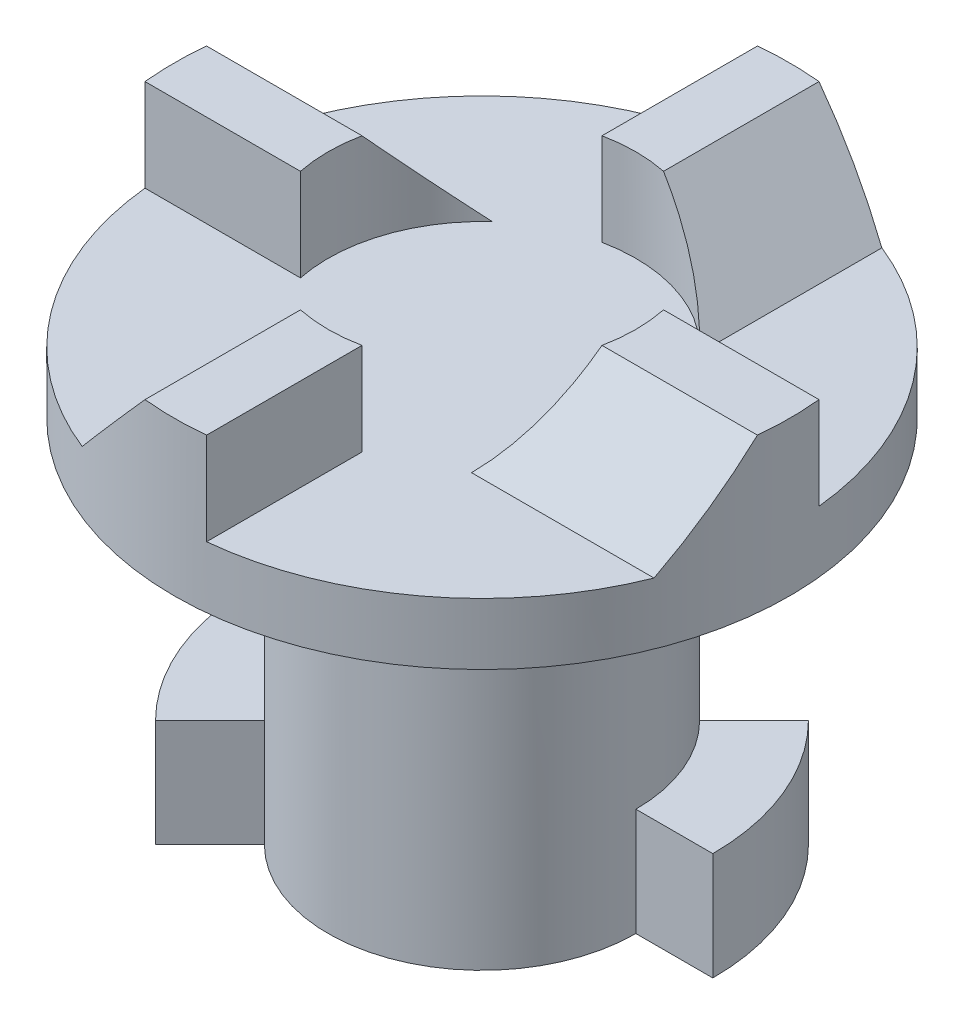
ISO-10303-21;
HEADER;
FILE_DESCRIPTION(('STEP AP214'),'2;1');
FILE_NAME('part.step','',(''),(''),'','','');
FILE_SCHEMA(('AUTOMOTIVE_DESIGN { 1 0 10303 214 1 1 1 1 }'));
ENDSEC;
DATA;
#1=APPLICATION_CONTEXT('core data for automotive mechanical design processes');
#2=APPLICATION_PROTOCOL_DEFINITION('international standard','automotive_design',2000,#1);
#3=PRODUCT_CONTEXT('',#1,'mechanical');
#4=PRODUCT('Part','Part','',(#3));
#5=PRODUCT_RELATED_PRODUCT_CATEGORY('part','',(#4));
#6=PRODUCT_DEFINITION_FORMATION('','',#4);
#7=PRODUCT_DEFINITION_CONTEXT('part definition',#1,'design');
#8=PRODUCT_DEFINITION('design','',#6,#7);
#9=PRODUCT_DEFINITION_SHAPE('','',#8);
#10=(LENGTH_UNIT() NAMED_UNIT(*) SI_UNIT(.MILLI.,.METRE.));
#11=(NAMED_UNIT(*) PLANE_ANGLE_UNIT() SI_UNIT($,.RADIAN.));
#12=(NAMED_UNIT(*) SI_UNIT($,.STERADIAN.) SOLID_ANGLE_UNIT());
#13=UNCERTAINTY_MEASURE_WITH_UNIT(LENGTH_MEASURE(1.E-05),#10,'distance_accuracy_value','');
#14=(GEOMETRIC_REPRESENTATION_CONTEXT(3) GLOBAL_UNCERTAINTY_ASSIGNED_CONTEXT((#13)) GLOBAL_UNIT_ASSIGNED_CONTEXT((#10,
#11,#12)) REPRESENTATION_CONTEXT('',''));
#15=CARTESIAN_POINT('',(0.,0.,0.));
#16=DIRECTION('',(0.,0.,1.));
#17=DIRECTION('',(1.,0.,0.));
#18=AXIS2_PLACEMENT_3D('',#15,#16,#17);
#19=CARTESIAN_POINT('',(0.,6.,0.));
#20=DIRECTION('',(0.,-1.,0.));
#21=DIRECTION('',(0.,0.,-1.));
#22=AXIS2_PLACEMENT_3D('',#19,#20,#21);
#23=CYLINDRICAL_SURFACE('',#22,5.);
#24=CARTESIAN_POINT('',(0.,-2.5,0.));
#25=DIRECTION('',(0.,-1.,0.));
#26=DIRECTION('',(0.,0.,-1.));
#27=AXIS2_PLACEMENT_3D('',#24,#25,#26);
#28=CIRCLE('',#27,5.);
#29=CARTESIAN_POINT('',(3.53553390593275,-2.5,-3.53553390593273));
#30=VERTEX_POINT('',#29);
#31=CARTESIAN_POINT('',(5.,-2.5,0.));
#32=VERTEX_POINT('',#31);
#33=EDGE_CURVE('E210',#30,#32,#28,.T.);
#34=ORIENTED_EDGE('',*,*,#33,.F.);
#35=DIRECTION('',(0.,-1.,0.));
#36=VECTOR('',#35,1.);
#37=CARTESIAN_POINT('',(3.53553390593275,-2.5,-3.53553390593273));
#38=LINE('',#37,#36);
#39=CARTESIAN_POINT('',(3.53553390593275,-6.,-3.53553390593273));
#40=VERTEX_POINT('',#39);
#41=EDGE_CURVE('E223',#30,#40,#38,.T.);
#42=ORIENTED_EDGE('',*,*,#41,.T.);
#43=CARTESIAN_POINT('',(0.,-6.,0.));
#44=DIRECTION('',(0.,-1.,0.));
#45=DIRECTION('',(0.,0.,-1.));
#46=AXIS2_PLACEMENT_3D('',#43,#44,#45);
#47=CIRCLE('',#46,5.);
#48=CARTESIAN_POINT('',(-5.,-6.,0.));
#49=VERTEX_POINT('',#48);
#50=EDGE_CURVE('E343',#49,#40,#47,.T.);
#51=ORIENTED_EDGE('',*,*,#50,.F.);
#52=DIRECTION('',(0.,-1.,0.));
#53=VECTOR('',#52,1.);
#54=CARTESIAN_POINT('',(-5.,-2.5,0.));
#55=LINE('',#54,#53);
#56=CARTESIAN_POINT('',(-5.,-2.5,0.));
#57=VERTEX_POINT('',#56);
#58=EDGE_CURVE('E256',#57,#49,#55,.T.);
#59=ORIENTED_EDGE('',*,*,#58,.F.);
#60=CARTESIAN_POINT('',(0.,-2.5,0.));
#61=DIRECTION('',(0.,-1.,0.));
#62=DIRECTION('',(0.,0.,-1.));
#63=AXIS2_PLACEMENT_3D('',#60,#61,#62);
#64=CIRCLE('',#63,5.);
#65=CARTESIAN_POINT('',(-3.53553390593272,-2.5,3.53553390593276));
#66=VERTEX_POINT('',#65);
#67=EDGE_CURVE('E244',#66,#57,#64,.T.);
#68=ORIENTED_EDGE('',*,*,#67,.F.);
#69=DIRECTION('',(0.,-1.,0.));
#70=VECTOR('',#69,1.);
#71=CARTESIAN_POINT('',(-3.53553390593272,-2.5,3.53553390593276));
#72=LINE('',#71,#70);
#73=CARTESIAN_POINT('',(-3.53553390593272,-6.,3.53553390593276));
#74=VERTEX_POINT('',#73);
#75=EDGE_CURVE('E252',#66,#74,#72,.T.);
#76=ORIENTED_EDGE('',*,*,#75,.T.);
#77=CARTESIAN_POINT('',(5.,-6.,0.));
#78=VERTEX_POINT('',#77);
#79=EDGE_CURVE('E370',#78,#74,#47,.T.);
#80=ORIENTED_EDGE('',*,*,#79,.F.);
#81=DIRECTION('',(0.,-1.,0.));
#82=VECTOR('',#81,1.);
#83=CARTESIAN_POINT('',(5.,-2.5,0.));
#84=LINE('',#83,#82);
#85=EDGE_CURVE('E234',#32,#78,#84,.T.);
#86=ORIENTED_EDGE('',*,*,#85,.F.);
#87=EDGE_LOOP('',(#34,#42,#51,#59,#68,#76,#80,#86));
#88=FACE_BOUND('',#87,.T.);
#89=CARTESIAN_POINT('',(0.,4.,0.));
#90=DIRECTION('',(0.,1.,0.));
#91=DIRECTION('',(0.,0.,1.));
#92=AXIS2_PLACEMENT_3D('',#89,#90,#91);
#93=CIRCLE('',#92,5.);
#94=CARTESIAN_POINT('',(0.,4.,5.));
#95=VERTEX_POINT('',#94);
#96=EDGE_CURVE('E11',#95,#95,#93,.F.);
#97=ORIENTED_EDGE('',*,*,#96,.T.);
#98=EDGE_LOOP('',(#97));
#99=FACE_BOUND('',#98,.T.);
#100=ADVANCED_FACE('F38',(#88,#99),#23,.T.);
#101=CARTESIAN_POINT('',(0.,11.,0.));
#102=DIRECTION('',(0.,1.,0.));
#103=DIRECTION('',(0.,0.,1.));
#104=AXIS2_PLACEMENT_3D('',#101,#102,#103);
#105=PLANE('',#104);
#106=CARTESIAN_POINT('',(0.,11.,0.));
#107=DIRECTION('',(0.,1.,0.));
#108=DIRECTION('',(0.,0.,1.));
#109=AXIS2_PLACEMENT_3D('',#106,#107,#108);
#110=CIRCLE('',#109,5.);
#111=CARTESIAN_POINT('',(4.89897948556637,11.,0.999999999999948));
#112=VERTEX_POINT('',#111);
#113=CARTESIAN_POINT('',(4.89897948556636,11.,-1.));
#114=VERTEX_POINT('',#113);
#115=EDGE_CURVE('E263',#112,#114,#110,.T.);
#116=ORIENTED_EDGE('',*,*,#115,.F.);
#117=DIRECTION('',(1.,0.,0.));
#118=VECTOR('',#117,1.);
#119=CARTESIAN_POINT('',(4.89897948556636,11.,1.));
#120=LINE('',#119,#118);
#121=CARTESIAN_POINT('',(9.94987437106621,11.,1.));
#122=VERTEX_POINT('',#121);
#123=EDGE_CURVE('E320',#112,#122,#120,.T.);
#124=ORIENTED_EDGE('',*,*,#123,.T.);
#125=CARTESIAN_POINT('',(0.,11.,0.));
#126=DIRECTION('',(0.,1.,0.));
#127=DIRECTION('',(0.,0.,1.));
#128=AXIS2_PLACEMENT_3D('',#125,#126,#127);
#129=CIRCLE('',#128,10.);
#130=CARTESIAN_POINT('',(9.9498743710662,11.,-1.));
#131=VERTEX_POINT('',#130);
#132=EDGE_CURVE('E271',#122,#131,#129,.T.);
#133=ORIENTED_EDGE('',*,*,#132,.T.);
#134=DIRECTION('',(-1.,0.,0.));
#135=VECTOR('',#134,1.);
#136=CARTESIAN_POINT('',(4.89897948556636,11.,-1.));
#137=LINE('',#136,#135);
#138=EDGE_CURVE('E323',#131,#114,#137,.T.);
#139=ORIENTED_EDGE('',*,*,#138,.T.);
#140=EDGE_LOOP('',(#116,#124,#133,#139));
#141=FACE_BOUND('',#140,.T.);
#142=ADVANCED_FACE('F393',(#141),#105,.T.);
#143=CARTESIAN_POINT('',(1.,11.,-4.89897948556636));
#144=VERTEX_POINT('',#143);
#145=CARTESIAN_POINT('',(-1.,11.,-4.89897948556636));
#146=VERTEX_POINT('',#145);
#147=EDGE_CURVE('E739',#144,#146,#110,.T.);
#148=ORIENTED_EDGE('',*,*,#147,.F.);
#149=DIRECTION('',(0.,0.,-1.));
#150=VECTOR('',#149,1.);
#151=CARTESIAN_POINT('',(1.,11.,-10.));
#152=LINE('',#151,#150);
#153=CARTESIAN_POINT('',(1.,11.,-9.9498743710662));
#154=VERTEX_POINT('',#153);
#155=EDGE_CURVE('E326',#144,#154,#152,.T.);
#156=ORIENTED_EDGE('',*,*,#155,.T.);
#157=CARTESIAN_POINT('',(-1.,11.,-9.9498743710662));
#158=VERTEX_POINT('',#157);
#159=EDGE_CURVE('E750',#154,#158,#129,.T.);
#160=ORIENTED_EDGE('',*,*,#159,.T.);
#161=DIRECTION('',(0.,0.,1.));
#162=VECTOR('',#161,1.);
#163=CARTESIAN_POINT('',(-1.,11.,-10.));
#164=LINE('',#163,#162);
#165=EDGE_CURVE('E329',#158,#146,#164,.T.);
#166=ORIENTED_EDGE('',*,*,#165,.T.);
#167=EDGE_LOOP('',(#148,#156,#160,#166));
#168=FACE_BOUND('',#167,.T.);
#169=ADVANCED_FACE('F398',(#168),#105,.T.);
#170=CARTESIAN_POINT('',(-4.89897948556636,11.,-0.999999999999983));
#171=VERTEX_POINT('',#170);
#172=CARTESIAN_POINT('',(-4.89897948556636,11.,1.));
#173=VERTEX_POINT('',#172);
#174=EDGE_CURVE('E262',#171,#173,#110,.T.);
#175=ORIENTED_EDGE('',*,*,#174,.F.);
#176=DIRECTION('',(-1.,0.,0.));
#177=VECTOR('',#176,1.);
#178=CARTESIAN_POINT('',(-10.,11.,-1.));
#179=LINE('',#178,#177);
#180=CARTESIAN_POINT('',(-9.9498743710662,11.,-1.));
#181=VERTEX_POINT('',#180);
#182=EDGE_CURVE('E332',#171,#181,#179,.T.);
#183=ORIENTED_EDGE('',*,*,#182,.T.);
#184=CARTESIAN_POINT('',(-9.9498743710662,11.,1.));
#185=VERTEX_POINT('',#184);
#186=EDGE_CURVE('E270',#181,#185,#129,.T.);
#187=ORIENTED_EDGE('',*,*,#186,.T.);
#188=DIRECTION('',(1.,0.,0.));
#189=VECTOR('',#188,1.);
#190=CARTESIAN_POINT('',(-10.,11.,1.));
#191=LINE('',#190,#189);
#192=EDGE_CURVE('E335',#185,#173,#191,.T.);
#193=ORIENTED_EDGE('',*,*,#192,.T.);
#194=EDGE_LOOP('',(#175,#183,#187,#193));
#195=FACE_BOUND('',#194,.T.);
#196=ADVANCED_FACE('F419',(#195),#105,.T.);
#197=CARTESIAN_POINT('',(1.,11.,4.89897948556636));
#198=DIRECTION('',(-1.,0.,0.));
#199=DIRECTION('',(0.,0.,1.));
#200=AXIS2_PLACEMENT_3D('',#197,#198,#199);
#201=PLANE('',#200);
#202=DIRECTION('',(0.,1.,0.));
#203=VECTOR('',#202,1.);
#204=CARTESIAN_POINT('',(1.,-6.,9.9498743710662));
#205=LINE('',#204,#203);
#206=CARTESIAN_POINT('',(1.,8.,9.9498743710662));
#207=VERTEX_POINT('',#206);
#208=CARTESIAN_POINT('',(1.,11.,9.9498743710662));
#209=VERTEX_POINT('',#208);
#210=EDGE_CURVE('E287',#207,#209,#205,.T.);
#211=ORIENTED_EDGE('',*,*,#210,.F.);
#212=DIRECTION('',(0.,0.,-1.));
#213=VECTOR('',#212,1.);
#214=CARTESIAN_POINT('',(1.,8.,4.89897948556636));
#215=LINE('',#214,#213);
#216=CARTESIAN_POINT('',(1.,8.,4.89897948556636));
#217=VERTEX_POINT('',#216);
#218=EDGE_CURVE('E339',#207,#217,#215,.T.);
#219=ORIENTED_EDGE('',*,*,#218,.T.);
#220=DIRECTION('',(0.,-1.,0.));
#221=VECTOR('',#220,1.);
#222=CARTESIAN_POINT('',(1.,11.,4.89897948556636));
#223=LINE('',#222,#221);
#224=CARTESIAN_POINT('',(1.,11.,4.89897948556636));
#225=VERTEX_POINT('',#224);
#226=EDGE_CURVE('E359',#225,#217,#223,.T.);
#227=ORIENTED_EDGE('',*,*,#226,.F.);
#228=DIRECTION('',(0.,0.,-1.));
#229=VECTOR('',#228,1.);
#230=CARTESIAN_POINT('',(1.,11.,4.89897948556636));
#231=LINE('',#230,#229);
#232=EDGE_CURVE('E317',#209,#225,#231,.T.);
#233=ORIENTED_EDGE('',*,*,#232,.F.);
#234=EDGE_LOOP('',(#211,#219,#227,#233));
#235=FACE_BOUND('',#234,.T.);
#236=ADVANCED_FACE('F415',(#235),#201,.F.);
#237=CARTESIAN_POINT('',(4.89897948556636,11.,-1.));
#238=DIRECTION('',(0.,0.,1.));
#239=DIRECTION('',(1.,0.,0.));
#240=AXIS2_PLACEMENT_3D('',#237,#238,#239);
#241=PLANE('',#240);
#242=DIRECTION('',(0.,1.,0.));
#243=VECTOR('',#242,1.);
#244=CARTESIAN_POINT('',(9.9498743710662,-6.,-1.));
#245=LINE('',#244,#243);
#246=CARTESIAN_POINT('',(9.9498743710662,8.,-1.));
#247=VERTEX_POINT('',#246);
#248=EDGE_CURVE('E285',#247,#131,#245,.T.);
#249=ORIENTED_EDGE('',*,*,#248,.F.);
#250=DIRECTION('',(-1.,0.,0.));
#251=VECTOR('',#250,1.);
#252=CARTESIAN_POINT('',(4.89897948556636,8.,-1.));
#253=LINE('',#252,#251);
#254=CARTESIAN_POINT('',(4.89897948556636,8.,-1.));
#255=VERTEX_POINT('',#254);
#256=EDGE_CURVE('E342',#247,#255,#253,.T.);
#257=ORIENTED_EDGE('',*,*,#256,.T.);
#258=DIRECTION('',(0.,-1.,0.));
#259=VECTOR('',#258,1.);
#260=CARTESIAN_POINT('',(4.89897948556636,11.,-1.));
#261=LINE('',#260,#259);
#262=EDGE_CURVE('E357',#114,#255,#261,.T.);
#263=ORIENTED_EDGE('',*,*,#262,.F.);
#264=ORIENTED_EDGE('',*,*,#138,.F.);
#265=EDGE_LOOP('',(#249,#257,#263,#264));
#266=FACE_BOUND('',#265,.T.);
#267=ADVANCED_FACE('F418',(#266),#241,.F.);
#268=CARTESIAN_POINT('',(-1.,11.,-10.));
#269=DIRECTION('',(1.,0.,0.));
#270=DIRECTION('',(0.,0.,-1.));
#271=AXIS2_PLACEMENT_3D('',#268,#269,#270);
#272=PLANE('',#271);
#273=DIRECTION('',(0.,1.,0.));
#274=VECTOR('',#273,1.);
#275=CARTESIAN_POINT('',(-1.,-6.,-9.9498743710662));
#276=LINE('',#275,#274);
#277=CARTESIAN_POINT('',(-1.,8.,-9.9498743710662));
#278=VERTEX_POINT('',#277);
#279=EDGE_CURVE('E283',#278,#158,#276,.T.);
#280=ORIENTED_EDGE('',*,*,#279,.F.);
#281=DIRECTION('',(0.,0.,1.));
#282=VECTOR('',#281,1.);
#283=CARTESIAN_POINT('',(-1.,8.,-10.));
#284=LINE('',#283,#282);
#285=CARTESIAN_POINT('',(-1.,8.,-4.89897948556636));
#286=VERTEX_POINT('',#285);
#287=EDGE_CURVE('E346',#278,#286,#284,.T.);
#288=ORIENTED_EDGE('',*,*,#287,.T.);
#289=DIRECTION('',(0.,-1.,0.));
#290=VECTOR('',#289,1.);
#291=CARTESIAN_POINT('',(-1.,11.,-4.89897948556636));
#292=LINE('',#291,#290);
#293=EDGE_CURVE('E355',#146,#286,#292,.T.);
#294=ORIENTED_EDGE('',*,*,#293,.F.);
#295=ORIENTED_EDGE('',*,*,#165,.F.);
#296=EDGE_LOOP('',(#280,#288,#294,#295));
#297=FACE_BOUND('',#296,.T.);
#298=ADVANCED_FACE('F423',(#297),#272,.F.);
#299=CARTESIAN_POINT('',(-10.,11.,1.));
#300=DIRECTION('',(0.,0.,-1.));
#301=DIRECTION('',(-1.,0.,0.));
#302=AXIS2_PLACEMENT_3D('',#299,#300,#301);
#303=PLANE('',#302);
#304=DIRECTION('',(0.,1.,0.));
#305=VECTOR('',#304,1.);
#306=CARTESIAN_POINT('',(-9.9498743710662,-6.,1.));
#307=LINE('',#306,#305);
#308=CARTESIAN_POINT('',(-9.9498743710662,8.,1.));
#309=VERTEX_POINT('',#308);
#310=EDGE_CURVE('E281',#309,#185,#307,.T.);
#311=ORIENTED_EDGE('',*,*,#310,.F.);
#312=DIRECTION('',(1.,0.,0.));
#313=VECTOR('',#312,1.);
#314=CARTESIAN_POINT('',(-10.,8.,1.));
#315=LINE('',#314,#313);
#316=CARTESIAN_POINT('',(-4.89897948556636,8.,1.));
#317=VERTEX_POINT('',#316);
#318=EDGE_CURVE('E349',#309,#317,#315,.T.);
#319=ORIENTED_EDGE('',*,*,#318,.T.);
#320=DIRECTION('',(0.,-1.,0.));
#321=VECTOR('',#320,1.);
#322=CARTESIAN_POINT('',(-4.89897948556636,11.,1.));
#323=LINE('',#322,#321);
#324=EDGE_CURVE('E338',#173,#317,#323,.T.);
#325=ORIENTED_EDGE('',*,*,#324,.F.);
#326=ORIENTED_EDGE('',*,*,#192,.F.);
#327=EDGE_LOOP('',(#311,#319,#325,#326));
#328=FACE_BOUND('',#327,.T.);
#329=ADVANCED_FACE('F427',(#328),#303,.F.);
#330=CARTESIAN_POINT('',(-1.,11.,4.89897948556636));
#331=VERTEX_POINT('',#330);
#332=EDGE_CURVE('E255',#331,#225,#110,.T.);
#333=ORIENTED_EDGE('',*,*,#332,.F.);
#334=DIRECTION('',(0.,0.,1.));
#335=VECTOR('',#334,1.);
#336=CARTESIAN_POINT('',(-1.,11.,4.89897948556636));
#337=LINE('',#336,#335);
#338=CARTESIAN_POINT('',(-1.,11.,9.9498743710662));
#339=VERTEX_POINT('',#338);
#340=EDGE_CURVE('E314',#331,#339,#337,.T.);
#341=ORIENTED_EDGE('',*,*,#340,.T.);
#342=EDGE_CURVE('E268',#339,#209,#129,.T.);
#343=ORIENTED_EDGE('',*,*,#342,.T.);
#344=ORIENTED_EDGE('',*,*,#232,.T.);
#345=EDGE_LOOP('',(#333,#341,#343,#344));
#346=FACE_BOUND('',#345,.T.);
#347=ADVANCED_FACE('F401',(#346),#105,.T.);
#348=CARTESIAN_POINT('',(1.,11.,10.002));
#349=DIRECTION('',(0.743144825477391,0.669130606358862,0.));
#350=DIRECTION('',(-0.669130606358862,0.743144825477391,0.));
#351=AXIS2_PLACEMENT_3D('',#348,#349,#350);
#352=PLANE('',#351);
#353=DIRECTION('',(0.,0.,-1.));
#354=VECTOR('',#353,1.);
#355=CARTESIAN_POINT('',(3.70121213289355,8.,10.002));
#356=LINE('',#355,#354);
#357=CARTESIAN_POINT('',(3.70121213289355,8.,-3.36170027624736));
#358=VERTEX_POINT('',#357);
#359=CARTESIAN_POINT('',(3.70121213289355,8.,-9.28983469967693));
#360=VERTEX_POINT('',#359);
#361=EDGE_CURVE('E308',#358,#360,#356,.T.);
#362=ORIENTED_EDGE('',*,*,#361,.T.);
#363=CARTESIAN_POINT('',(0.,12.1106125148292,0.));
#364=DIRECTION('',(0.743144825477391,0.669130606358862,0.));
#365=DIRECTION('',(-0.669130606358862,0.743144825477391,0.));
#366=AXIS2_PLACEMENT_3D('',#363,#364,#365);
#367=ELLIPSE('',#366,14.944765498646,10.);
#368=EDGE_CURVE('E278',#360,#154,#367,.T.);
#369=ORIENTED_EDGE('',*,*,#368,.T.);
#370=ORIENTED_EDGE('',*,*,#155,.F.);
#371=CARTESIAN_POINT('',(0.,12.1106125148292,0.));
#372=DIRECTION('',(0.743144825477391,0.669130606358862,0.));
#373=DIRECTION('',(0.669130606358862,-0.743144825477391,0.));
#374=AXIS2_PLACEMENT_3D('',#371,#372,#373);
#375=ELLIPSE('',#374,7.472382749323,5.);
#376=EDGE_CURVE('E311',#144,#358,#375,.F.);
#377=ORIENTED_EDGE('',*,*,#376,.T.);
#378=EDGE_LOOP('',(#362,#369,#370,#377));
#379=FACE_BOUND('',#378,.T.);
#380=ADVANCED_FACE('F433',(#379),#352,.T.);
#381=CARTESIAN_POINT('',(10.002,11.,-1.00000000000003));
#382=DIRECTION('',(0.,0.669130606358862,-0.743144825477391));
#383=DIRECTION('',(0.,0.743144825477391,0.669130606358862));
#384=AXIS2_PLACEMENT_3D('',#381,#382,#383);
#385=PLANE('',#384);
#386=DIRECTION('',(-1.,0.,0.));
#387=VECTOR('',#386,1.);
#388=CARTESIAN_POINT('',(10.002,8.,-3.70121213289358));
#389=LINE('',#388,#387);
#390=CARTESIAN_POINT('',(-3.36170027624738,8.,-3.70121213289353));
#391=VERTEX_POINT('',#390);
#392=CARTESIAN_POINT('',(-9.28983469967694,8.,-3.70121213289351));
#393=VERTEX_POINT('',#392);
#394=EDGE_CURVE('E302',#391,#393,#389,.T.);
#395=ORIENTED_EDGE('',*,*,#394,.T.);
#396=CARTESIAN_POINT('',(0.,12.1106125148292,0.));
#397=DIRECTION('',(0.,0.669130606358862,-0.743144825477391));
#398=DIRECTION('',(0.,0.743144825477391,0.669130606358862));
#399=AXIS2_PLACEMENT_3D('',#396,#397,#398);
#400=ELLIPSE('',#399,14.944765498646,10.);
#401=EDGE_CURVE('E275',#393,#181,#400,.T.);
#402=ORIENTED_EDGE('',*,*,#401,.T.);
#403=ORIENTED_EDGE('',*,*,#182,.F.);
#404=CARTESIAN_POINT('',(0.,12.1106125148292,0.));
#405=DIRECTION('',(0.,0.669130606358862,-0.743144825477391));
#406=DIRECTION('',(0.,-0.743144825477391,-0.669130606358862));
#407=AXIS2_PLACEMENT_3D('',#404,#405,#406);
#408=ELLIPSE('',#407,7.472382749323,5.);
#409=EDGE_CURVE('E305',#171,#391,#408,.F.);
#410=ORIENTED_EDGE('',*,*,#409,.T.);
#411=EDGE_LOOP('',(#395,#402,#403,#410));
#412=FACE_BOUND('',#411,.T.);
#413=ADVANCED_FACE('F437',(#412),#385,.T.);
#414=CARTESIAN_POINT('',(-1.,11.,-10.002));
#415=DIRECTION('',(-0.743144825477391,0.669130606358862,0.));
#416=DIRECTION('',(-0.669130606358862,-0.743144825477391,0.));
#417=AXIS2_PLACEMENT_3D('',#414,#415,#416);
#418=PLANE('',#417);
#419=DIRECTION('',(0.,0.,1.));
#420=VECTOR('',#419,1.);
#421=CARTESIAN_POINT('',(-3.70121213289355,8.,-10.002));
#422=LINE('',#421,#420);
#423=CARTESIAN_POINT('',(-3.70121213289355,8.,3.36170027624736));
#424=VERTEX_POINT('',#423);
#425=CARTESIAN_POINT('',(-3.70121213289355,8.,9.28983469967693));
#426=VERTEX_POINT('',#425);
#427=EDGE_CURVE('E296',#424,#426,#422,.T.);
#428=ORIENTED_EDGE('',*,*,#427,.T.);
#429=CARTESIAN_POINT('',(0.,12.1106125148292,0.));
#430=DIRECTION('',(-0.743144825477391,0.669130606358862,0.));
#431=DIRECTION('',(0.669130606358862,0.743144825477391,0.));
#432=AXIS2_PLACEMENT_3D('',#429,#430,#431);
#433=ELLIPSE('',#432,14.944765498646,10.);
#434=EDGE_CURVE('E272',#426,#339,#433,.T.);
#435=ORIENTED_EDGE('',*,*,#434,.T.);
#436=ORIENTED_EDGE('',*,*,#340,.F.);
#437=CARTESIAN_POINT('',(0.,12.1106125148292,0.));
#438=DIRECTION('',(-0.743144825477391,0.669130606358862,0.));
#439=DIRECTION('',(-0.669130606358862,-0.743144825477391,0.));
#440=AXIS2_PLACEMENT_3D('',#437,#438,#439);
#441=ELLIPSE('',#440,7.472382749323,5.);
#442=EDGE_CURVE('E299',#331,#424,#441,.F.);
#443=ORIENTED_EDGE('',*,*,#442,.T.);
#444=EDGE_LOOP('',(#428,#435,#436,#443));
#445=FACE_BOUND('',#444,.T.);
#446=ADVANCED_FACE('F441',(#445),#418,.T.);
#447=CARTESIAN_POINT('',(-10.002,11.,1.0000000000001));
#448=DIRECTION('',(0.,0.669130606358862,0.743144825477391));
#449=DIRECTION('',(0.,-0.743144825477391,0.669130606358862));
#450=AXIS2_PLACEMENT_3D('',#447,#448,#449);
#451=PLANE('',#450);
#452=DIRECTION('',(1.,0.,0.));
#453=VECTOR('',#452,1.);
#454=CARTESIAN_POINT('',(-10.002,8.,3.70121213289365));
#455=LINE('',#454,#453);
#456=CARTESIAN_POINT('',(3.3617002762474,8.,3.70121213289351));
#457=VERTEX_POINT('',#456);
#458=CARTESIAN_POINT('',(9.28983469967697,8.,3.70121213289345));
#459=VERTEX_POINT('',#458);
#460=EDGE_CURVE('E293',#457,#459,#455,.T.);
#461=ORIENTED_EDGE('',*,*,#460,.T.);
#462=CARTESIAN_POINT('',(0.,12.1106125148292,0.));
#463=DIRECTION('',(0.,0.669130606358862,0.743144825477391));
#464=DIRECTION('',(0.,0.743144825477391,-0.669130606358862));
#465=AXIS2_PLACEMENT_3D('',#462,#463,#464);
#466=ELLIPSE('',#465,14.944765498646,10.);
#467=EDGE_CURVE('E352',#459,#122,#466,.T.);
#468=ORIENTED_EDGE('',*,*,#467,.T.);
#469=ORIENTED_EDGE('',*,*,#123,.F.);
#470=CARTESIAN_POINT('',(0.,12.1106125148292,0.));
#471=DIRECTION('',(0.,0.669130606358862,0.743144825477391));
#472=DIRECTION('',(0.,-0.743144825477391,0.669130606358862));
#473=AXIS2_PLACEMENT_3D('',#470,#471,#472);
#474=ELLIPSE('',#473,7.472382749323,5.);
#475=EDGE_CURVE('E290',#112,#457,#474,.F.);
#476=ORIENTED_EDGE('',*,*,#475,.T.);
#477=EDGE_LOOP('',(#461,#468,#469,#476));
#478=FACE_BOUND('',#477,.T.);
#479=ADVANCED_FACE('F408',(#478),#451,.T.);
#480=CARTESIAN_POINT('',(0.,-6.,0.));
#481=DIRECTION('',(0.,-1.,0.));
#482=DIRECTION('',(0.,0.,-1.));
#483=AXIS2_PLACEMENT_3D('',#480,#481,#482);
#484=PLANE('',#483);
#485=ORIENTED_EDGE('',*,*,#50,.T.);
#486=DIRECTION('',(0.707106781186548,0.,-0.707106781186547));
#487=VECTOR('',#486,1.);
#488=CARTESIAN_POINT('',(0.,-6.,0.));
#489=LINE('',#488,#487);
#490=CARTESIAN_POINT('',(5.30330085889912,-6.,-5.3033008588991));
#491=VERTEX_POINT('',#490);
#492=EDGE_CURVE('E229',#40,#491,#489,.T.);
#493=ORIENTED_EDGE('',*,*,#492,.T.);
#494=CARTESIAN_POINT('',(0.,-6.,0.));
#495=DIRECTION('',(0.,-1.,0.));
#496=DIRECTION('',(0.,0.,-1.));
#497=AXIS2_PLACEMENT_3D('',#494,#495,#496);
#498=CIRCLE('',#497,7.5);
#499=CARTESIAN_POINT('',(7.5,-6.,0.));
#500=VERTEX_POINT('',#499);
#501=EDGE_CURVE('E205',#491,#500,#498,.T.);
#502=ORIENTED_EDGE('',*,*,#501,.T.);
#503=DIRECTION('',(1.,0.,0.));
#504=VECTOR('',#503,1.);
#505=CARTESIAN_POINT('',(0.,-6.,0.));
#506=LINE('',#505,#504);
#507=EDGE_CURVE('E53',#78,#500,#506,.T.);
#508=ORIENTED_EDGE('',*,*,#507,.F.);
#509=ORIENTED_EDGE('',*,*,#79,.T.);
#510=DIRECTION('',(0.707106781186544,0.,-0.707106781186551));
#511=VECTOR('',#510,1.);
#512=CARTESIAN_POINT('',(0.,-6.,0.));
#513=LINE('',#512,#511);
#514=CARTESIAN_POINT('',(-5.30330085889908,-6.,5.30330085889913));
#515=VERTEX_POINT('',#514);
#516=EDGE_CURVE('E233',#515,#74,#513,.T.);
#517=ORIENTED_EDGE('',*,*,#516,.F.);
#518=CARTESIAN_POINT('',(0.,-6.,0.));
#519=DIRECTION('',(0.,-1.,0.));
#520=DIRECTION('',(0.,0.,-1.));
#521=AXIS2_PLACEMENT_3D('',#518,#519,#520);
#522=CIRCLE('',#521,7.5);
#523=CARTESIAN_POINT('',(-7.5,-6.,0.));
#524=VERTEX_POINT('',#523);
#525=EDGE_CURVE('E249',#515,#524,#522,.T.);
#526=ORIENTED_EDGE('',*,*,#525,.T.);
#527=DIRECTION('',(-1.,0.,0.));
#528=VECTOR('',#527,1.);
#529=CARTESIAN_POINT('',(0.,-6.,0.));
#530=LINE('',#529,#528);
#531=EDGE_CURVE('E60',#49,#524,#530,.T.);
#532=ORIENTED_EDGE('',*,*,#531,.F.);
#533=EDGE_LOOP('',(#485,#493,#502,#508,#509,#517,#526,#532));
#534=FACE_BOUND('',#533,.T.);
#535=ADVANCED_FACE('F404',(#534),#484,.T.);
#536=CARTESIAN_POINT('',(0.,8.,0.));
#537=DIRECTION('',(0.,-1.,0.));
#538=DIRECTION('',(0.,0.,-1.));
#539=AXIS2_PLACEMENT_3D('',#536,#537,#538);
#540=CYLINDRICAL_SURFACE('',#539,10.);
#541=CARTESIAN_POINT('',(0.,8.,0.));
#542=DIRECTION('',(0.,1.,0.));
#543=DIRECTION('',(0.,0.,1.));
#544=AXIS2_PLACEMENT_3D('',#541,#542,#543);
#545=CIRCLE('',#544,10.);
#546=EDGE_CURVE('E366',#207,#459,#545,.T.);
#547=ORIENTED_EDGE('',*,*,#546,.F.);
#548=ORIENTED_EDGE('',*,*,#210,.T.);
#549=ORIENTED_EDGE('',*,*,#342,.F.);
#550=ORIENTED_EDGE('',*,*,#434,.F.);
#551=EDGE_CURVE('E362',#309,#426,#545,.T.);
#552=ORIENTED_EDGE('',*,*,#551,.F.);
#553=ORIENTED_EDGE('',*,*,#310,.T.);
#554=ORIENTED_EDGE('',*,*,#186,.F.);
#555=ORIENTED_EDGE('',*,*,#401,.F.);
#556=EDGE_CURVE('E365',#278,#393,#545,.T.);
#557=ORIENTED_EDGE('',*,*,#556,.F.);
#558=ORIENTED_EDGE('',*,*,#279,.T.);
#559=ORIENTED_EDGE('',*,*,#159,.F.);
#560=ORIENTED_EDGE('',*,*,#368,.F.);
#561=EDGE_CURVE('E749',#247,#360,#545,.T.);
#562=ORIENTED_EDGE('',*,*,#561,.F.);
#563=ORIENTED_EDGE('',*,*,#248,.T.);
#564=ORIENTED_EDGE('',*,*,#132,.F.);
#565=ORIENTED_EDGE('',*,*,#467,.F.);
#566=EDGE_LOOP('',(#547,#548,#549,#550,#552,#553,#554,#555,#557,#558,#559,#560,#562,#563,#564,#565));
#567=FACE_BOUND('',#566,.T.);
#568=CARTESIAN_POINT('',(0.,6.,0.));
#569=DIRECTION('',(0.,1.,0.));
#570=DIRECTION('',(0.,0.,1.));
#571=AXIS2_PLACEMENT_3D('',#568,#569,#570);
#572=CIRCLE('',#571,10.);
#573=CARTESIAN_POINT('',(0.,6.,10.));
#574=VERTEX_POINT('',#573);
#575=EDGE_CURVE('E361',#574,#574,#572,.T.);
#576=ORIENTED_EDGE('',*,*,#575,.T.);
#577=EDGE_LOOP('',(#576));
#578=FACE_BOUND('',#577,.T.);
#579=ADVANCED_FACE('F407',(#567,#578),#540,.T.);
#580=CARTESIAN_POINT('',(0.,8.,0.));
#581=DIRECTION('',(0.,1.,0.));
#582=DIRECTION('',(0.,0.,1.));
#583=AXIS2_PLACEMENT_3D('',#580,#581,#582);
#584=PLANE('',#583);
#585=ORIENTED_EDGE('',*,*,#460,.F.);
#586=CARTESIAN_POINT('',(0.,8.,0.));
#587=DIRECTION('',(0.,1.,0.));
#588=DIRECTION('',(0.,0.,1.));
#589=AXIS2_PLACEMENT_3D('',#586,#587,#588);
#590=CIRCLE('',#589,5.);
#591=EDGE_CURVE('E266',#255,#457,#590,.F.);
#592=ORIENTED_EDGE('',*,*,#591,.F.);
#593=ORIENTED_EDGE('',*,*,#256,.F.);
#594=ORIENTED_EDGE('',*,*,#561,.T.);
#595=ORIENTED_EDGE('',*,*,#361,.F.);
#596=EDGE_CURVE('E785',#286,#358,#590,.F.);
#597=ORIENTED_EDGE('',*,*,#596,.F.);
#598=ORIENTED_EDGE('',*,*,#287,.F.);
#599=ORIENTED_EDGE('',*,*,#556,.T.);
#600=ORIENTED_EDGE('',*,*,#394,.F.);
#601=EDGE_CURVE('E267',#317,#391,#590,.F.);
#602=ORIENTED_EDGE('',*,*,#601,.F.);
#603=ORIENTED_EDGE('',*,*,#318,.F.);
#604=ORIENTED_EDGE('',*,*,#551,.T.);
#605=ORIENTED_EDGE('',*,*,#427,.F.);
#606=EDGE_CURVE('E264',#217,#424,#590,.F.);
#607=ORIENTED_EDGE('',*,*,#606,.F.);
#608=ORIENTED_EDGE('',*,*,#218,.F.);
#609=ORIENTED_EDGE('',*,*,#546,.T.);
#610=EDGE_LOOP('',(#585,#592,#593,#594,#595,#597,#598,#599,#600,#602,#603,#604,#605,#607,#608,#609));
#611=FACE_BOUND('',#610,.T.);
#612=ADVANCED_FACE('F389',(#611),#584,.T.);
#613=CARTESIAN_POINT('',(0.,6.,0.));
#614=DIRECTION('',(0.,1.,0.));
#615=DIRECTION('',(0.,0.,1.));
#616=AXIS2_PLACEMENT_3D('',#613,#614,#615);
#617=PLANE('',#616);
#618=CARTESIAN_POINT('',(0.,6.,0.));
#619=DIRECTION('',(0.,1.,0.));
#620=DIRECTION('',(0.,0.,1.));
#621=AXIS2_PLACEMENT_3D('',#618,#619,#620);
#622=CIRCLE('',#621,7.);
#623=CARTESIAN_POINT('',(0.,6.,7.));
#624=VERTEX_POINT('',#623);
#625=EDGE_CURVE('E46',#624,#624,#622,.T.);
#626=ORIENTED_EDGE('',*,*,#625,.T.);
#627=EDGE_LOOP('',(#626));
#628=FACE_BOUND('',#627,.T.);
#629=ORIENTED_EDGE('',*,*,#575,.F.);
#630=EDGE_LOOP('',(#629));
#631=FACE_BOUND('',#630,.T.);
#632=ADVANCED_FACE('F375',(#628,#631),#617,.F.);
#633=CARTESIAN_POINT('',(0.,4.,0.));
#634=DIRECTION('',(0.,1.,0.));
#635=DIRECTION('',(0.,0.,1.));
#636=AXIS2_PLACEMENT_3D('',#633,#634,#635);
#637=TOROIDAL_SURFACE('',#636,7.,2.);
#638=ORIENTED_EDGE('',*,*,#96,.F.);
#639=EDGE_LOOP('',(#638));
#640=FACE_BOUND('',#639,.T.);
#641=ORIENTED_EDGE('',*,*,#625,.F.);
#642=EDGE_LOOP('',(#641));
#643=FACE_BOUND('',#642,.T.);
#644=ADVANCED_FACE('F40',(#640,#643),#637,.F.);
#645=CARTESIAN_POINT('',(0.,-6.14213562373095,0.));
#646=DIRECTION('',(0.,1.,0.));
#647=DIRECTION('',(0.,0.,1.));
#648=AXIS2_PLACEMENT_3D('',#645,#646,#647);
#649=CYLINDRICAL_SURFACE('',#648,5.);
#650=ORIENTED_EDGE('',*,*,#606,.T.);
#651=ORIENTED_EDGE('',*,*,#442,.F.);
#652=ORIENTED_EDGE('',*,*,#332,.T.);
#653=ORIENTED_EDGE('',*,*,#226,.T.);
#654=EDGE_LOOP('',(#650,#651,#652,#653));
#655=FACE_BOUND('',#654,.T.);
#656=ADVANCED_FACE('F379',(#655),#649,.F.);
#657=ORIENTED_EDGE('',*,*,#591,.T.);
#658=ORIENTED_EDGE('',*,*,#475,.F.);
#659=ORIENTED_EDGE('',*,*,#115,.T.);
#660=ORIENTED_EDGE('',*,*,#262,.T.);
#661=EDGE_LOOP('',(#657,#658,#659,#660));
#662=FACE_BOUND('',#661,.T.);
#663=ADVANCED_FACE('F385',(#662),#649,.F.);
#664=ORIENTED_EDGE('',*,*,#596,.T.);
#665=ORIENTED_EDGE('',*,*,#376,.F.);
#666=ORIENTED_EDGE('',*,*,#147,.T.);
#667=ORIENTED_EDGE('',*,*,#293,.T.);
#668=EDGE_LOOP('',(#664,#665,#666,#667));
#669=FACE_BOUND('',#668,.T.);
#670=ADVANCED_FACE('F511',(#669),#649,.F.);
#671=ORIENTED_EDGE('',*,*,#601,.T.);
#672=ORIENTED_EDGE('',*,*,#409,.F.);
#673=ORIENTED_EDGE('',*,*,#174,.T.);
#674=ORIENTED_EDGE('',*,*,#324,.T.);
#675=EDGE_LOOP('',(#671,#672,#673,#674));
#676=FACE_BOUND('',#675,.T.);
#677=ADVANCED_FACE('F388',(#676),#649,.F.);
#678=CARTESIAN_POINT('',(0.,-2.5,0.));
#679=DIRECTION('',(-0.707106781186551,0.,-0.707106781186544));
#680=DIRECTION('',(-0.707106781186544,0.,0.707106781186551));
#681=AXIS2_PLACEMENT_3D('',#678,#679,#680);
#682=PLANE('',#681);
#683=ORIENTED_EDGE('',*,*,#516,.T.);
#684=ORIENTED_EDGE('',*,*,#75,.F.);
#685=DIRECTION('',(0.707106781186544,0.,-0.707106781186551));
#686=VECTOR('',#685,1.);
#687=CARTESIAN_POINT('',(0.,-2.5,0.));
#688=LINE('',#687,#686);
#689=CARTESIAN_POINT('',(-5.30330085889908,-2.5,5.30330085889913));
#690=VERTEX_POINT('',#689);
#691=EDGE_CURVE('E237',#690,#66,#688,.T.);
#692=ORIENTED_EDGE('',*,*,#691,.F.);
#693=DIRECTION('',(0.,-1.,0.));
#694=VECTOR('',#693,1.);
#695=CARTESIAN_POINT('',(-5.30330085889908,-2.5,5.30330085889913));
#696=LINE('',#695,#694);
#697=EDGE_CURVE('E246',#690,#515,#696,.T.);
#698=ORIENTED_EDGE('',*,*,#697,.T.);
#699=EDGE_LOOP('',(#683,#684,#692,#698));
#700=FACE_BOUND('',#699,.T.);
#701=ADVANCED_FACE('F449',(#700),#682,.F.);
#702=CARTESIAN_POINT('',(0.,-2.5,0.));
#703=DIRECTION('',(0.,0.,1.));
#704=DIRECTION('',(1.,0.,0.));
#705=AXIS2_PLACEMENT_3D('',#702,#703,#704);
#706=PLANE('',#705);
#707=ORIENTED_EDGE('',*,*,#531,.T.);
#708=DIRECTION('',(0.,-1.,0.));
#709=VECTOR('',#708,1.);
#710=CARTESIAN_POINT('',(-7.5,-2.5,0.));
#711=LINE('',#710,#709);
#712=CARTESIAN_POINT('',(-7.5,-2.5,0.));
#713=VERTEX_POINT('',#712);
#714=EDGE_CURVE('E258',#713,#524,#711,.T.);
#715=ORIENTED_EDGE('',*,*,#714,.F.);
#716=DIRECTION('',(-1.,0.,0.));
#717=VECTOR('',#716,1.);
#718=CARTESIAN_POINT('',(0.,-2.5,0.));
#719=LINE('',#718,#717);
#720=EDGE_CURVE('E242',#57,#713,#719,.T.);
#721=ORIENTED_EDGE('',*,*,#720,.F.);
#722=ORIENTED_EDGE('',*,*,#58,.T.);
#723=EDGE_LOOP('',(#707,#715,#721,#722));
#724=FACE_BOUND('',#723,.T.);
#725=ADVANCED_FACE('F452',(#724),#706,.F.);
#726=CARTESIAN_POINT('',(0.,-2.5,0.));
#727=DIRECTION('',(0.,-1.,0.));
#728=DIRECTION('',(0.,0.,-1.));
#729=AXIS2_PLACEMENT_3D('',#726,#727,#728);
#730=CYLINDRICAL_SURFACE('',#729,7.5);
#731=ORIENTED_EDGE('',*,*,#525,.F.);
#732=ORIENTED_EDGE('',*,*,#697,.F.);
#733=CARTESIAN_POINT('',(0.,-2.5,0.));
#734=DIRECTION('',(0.,-1.,0.));
#735=DIRECTION('',(0.,0.,-1.));
#736=AXIS2_PLACEMENT_3D('',#733,#734,#735);
#737=CIRCLE('',#736,7.5);
#738=EDGE_CURVE('E239',#690,#713,#737,.T.);
#739=ORIENTED_EDGE('',*,*,#738,.T.);
#740=ORIENTED_EDGE('',*,*,#714,.T.);
#741=EDGE_LOOP('',(#731,#732,#739,#740));
#742=FACE_BOUND('',#741,.T.);
#743=ADVANCED_FACE('F454',(#742),#730,.T.);
#744=CARTESIAN_POINT('',(0.,-2.5,0.));
#745=DIRECTION('',(0.,-1.,0.));
#746=DIRECTION('',(0.,0.,-1.));
#747=AXIS2_PLACEMENT_3D('',#744,#745,#746);
#748=PLANE('',#747);
#749=ORIENTED_EDGE('',*,*,#691,.T.);
#750=ORIENTED_EDGE('',*,*,#67,.T.);
#751=ORIENTED_EDGE('',*,*,#720,.T.);
#752=ORIENTED_EDGE('',*,*,#738,.F.);
#753=EDGE_LOOP('',(#749,#750,#751,#752));
#754=FACE_BOUND('',#753,.T.);
#755=ADVANCED_FACE('F457',(#754),#748,.F.);
#756=CARTESIAN_POINT('',(0.,-2.5,0.));
#757=DIRECTION('',(-0.707106781186547,0.,-0.707106781186548));
#758=DIRECTION('',(-0.707106781186548,0.,0.707106781186547));
#759=AXIS2_PLACEMENT_3D('',#756,#757,#758);
#760=PLANE('',#759);
#761=ORIENTED_EDGE('',*,*,#492,.F.);
#762=ORIENTED_EDGE('',*,*,#41,.F.);
#763=DIRECTION('',(0.707106781186548,0.,-0.707106781186547));
#764=VECTOR('',#763,1.);
#765=CARTESIAN_POINT('',(0.,-2.5,0.));
#766=LINE('',#765,#764);
#767=CARTESIAN_POINT('',(5.30330085889912,-2.5,-5.3033008588991));
#768=VERTEX_POINT('',#767);
#769=EDGE_CURVE('E215',#30,#768,#766,.T.);
#770=ORIENTED_EDGE('',*,*,#769,.T.);
#771=DIRECTION('',(0.,-1.,0.));
#772=VECTOR('',#771,1.);
#773=CARTESIAN_POINT('',(5.30330085889912,-2.5,-5.3033008588991));
#774=LINE('',#773,#772);
#775=EDGE_CURVE('E201',#768,#491,#774,.T.);
#776=ORIENTED_EDGE('',*,*,#775,.T.);
#777=EDGE_LOOP('',(#761,#762,#770,#776));
#778=FACE_BOUND('',#777,.T.);
#779=ADVANCED_FACE('F221',(#778),#760,.T.);
#780=CARTESIAN_POINT('',(0.,-2.5,0.));
#781=DIRECTION('',(0.,0.,-1.));
#782=DIRECTION('',(-1.,0.,0.));
#783=AXIS2_PLACEMENT_3D('',#780,#781,#782);
#784=PLANE('',#783);
#785=ORIENTED_EDGE('',*,*,#507,.T.);
#786=DIRECTION('',(0.,-1.,0.));
#787=VECTOR('',#786,1.);
#788=CARTESIAN_POINT('',(7.5,-2.5,0.));
#789=LINE('',#788,#787);
#790=CARTESIAN_POINT('',(7.5,-2.5,0.));
#791=VERTEX_POINT('',#790);
#792=EDGE_CURVE('E209',#791,#500,#789,.T.);
#793=ORIENTED_EDGE('',*,*,#792,.F.);
#794=DIRECTION('',(1.,0.,0.));
#795=VECTOR('',#794,1.);
#796=CARTESIAN_POINT('',(0.,-2.5,0.));
#797=LINE('',#796,#795);
#798=EDGE_CURVE('E218',#32,#791,#797,.T.);
#799=ORIENTED_EDGE('',*,*,#798,.F.);
#800=ORIENTED_EDGE('',*,*,#85,.T.);
#801=EDGE_LOOP('',(#785,#793,#799,#800));
#802=FACE_BOUND('',#801,.T.);
#803=ADVANCED_FACE('F467',(#802),#784,.F.);
#804=CARTESIAN_POINT('',(0.,-2.5,0.));
#805=DIRECTION('',(0.,-1.,0.));
#806=DIRECTION('',(0.,0.,-1.));
#807=AXIS2_PLACEMENT_3D('',#804,#805,#806);
#808=CYLINDRICAL_SURFACE('',#807,7.5);
#809=ORIENTED_EDGE('',*,*,#501,.F.);
#810=ORIENTED_EDGE('',*,*,#775,.F.);
#811=CARTESIAN_POINT('',(0.,-2.5,0.));
#812=DIRECTION('',(0.,-1.,0.));
#813=DIRECTION('',(0.,0.,-1.));
#814=AXIS2_PLACEMENT_3D('',#811,#812,#813);
#815=CIRCLE('',#814,7.5);
#816=EDGE_CURVE('E204',#768,#791,#815,.T.);
#817=ORIENTED_EDGE('',*,*,#816,.T.);
#818=ORIENTED_EDGE('',*,*,#792,.T.);
#819=EDGE_LOOP('',(#809,#810,#817,#818));
#820=FACE_BOUND('',#819,.T.);
#821=ADVANCED_FACE('F203',(#820),#808,.T.);
#822=CARTESIAN_POINT('',(0.,-2.5,0.));
#823=DIRECTION('',(0.,-1.,0.));
#824=DIRECTION('',(0.,0.,-1.));
#825=AXIS2_PLACEMENT_3D('',#822,#823,#824);
#826=PLANE('',#825);
#827=ORIENTED_EDGE('',*,*,#769,.F.);
#828=ORIENTED_EDGE('',*,*,#33,.T.);
#829=ORIENTED_EDGE('',*,*,#798,.T.);
#830=ORIENTED_EDGE('',*,*,#816,.F.);
#831=EDGE_LOOP('',(#827,#828,#829,#830));
#832=FACE_BOUND('',#831,.T.);
#833=ADVANCED_FACE('F214',(#832),#826,.F.);
#834=CLOSED_SHELL('',(#100,#142,#169,#196,#236,#267,#298,#329,#347,#380,#413,#446,#479,#535,
#579,#612,#632,#644,#656,#663,#670,#677,#701,#725,#743,#755,#779,#803,#821,#833));
#835=MANIFOLD_SOLID_BREP('B2',#834);
#836=ADVANCED_BREP_SHAPE_REPRESENTATION('',(#18,#835),#14);
#837=SHAPE_DEFINITION_REPRESENTATION(#9,#836);
ENDSEC;
END-ISO-10303-21;
